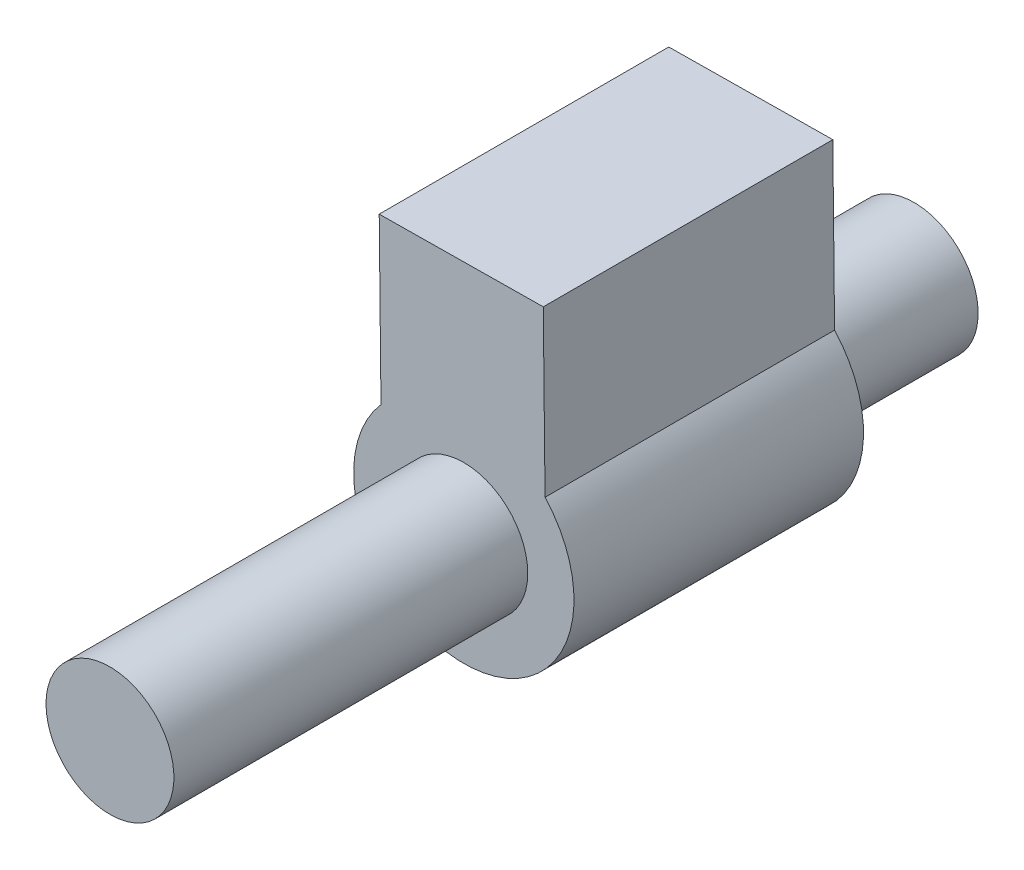
ISO-10303-21;
HEADER;
FILE_DESCRIPTION(('STEP AP214'),'2;1');
FILE_NAME('part.step','',(''),(''),'','','');
FILE_SCHEMA(('AUTOMOTIVE_DESIGN { 1 0 10303 214 1 1 1 1 }'));
ENDSEC;
DATA;
#1=APPLICATION_CONTEXT('core data for automotive mechanical design processes');
#2=APPLICATION_PROTOCOL_DEFINITION('international standard','automotive_design',2000,#1);
#3=PRODUCT_CONTEXT('',#1,'mechanical');
#4=PRODUCT('Part','Part','',(#3));
#5=PRODUCT_RELATED_PRODUCT_CATEGORY('part','',(#4));
#6=PRODUCT_DEFINITION_FORMATION('','',#4);
#7=PRODUCT_DEFINITION_CONTEXT('part definition',#1,'design');
#8=PRODUCT_DEFINITION('design','',#6,#7);
#9=PRODUCT_DEFINITION_SHAPE('','',#8);
#10=(LENGTH_UNIT() NAMED_UNIT(*) SI_UNIT(.MILLI.,.METRE.));
#11=(NAMED_UNIT(*) PLANE_ANGLE_UNIT() SI_UNIT($,.RADIAN.));
#12=(NAMED_UNIT(*) SI_UNIT($,.STERADIAN.) SOLID_ANGLE_UNIT());
#13=UNCERTAINTY_MEASURE_WITH_UNIT(LENGTH_MEASURE(1.E-05),#10,'distance_accuracy_value','');
#14=(GEOMETRIC_REPRESENTATION_CONTEXT(3) GLOBAL_UNCERTAINTY_ASSIGNED_CONTEXT((#13)) GLOBAL_UNIT_ASSIGNED_CONTEXT((#10,
#11,#12)) REPRESENTATION_CONTEXT('',''));
#15=CARTESIAN_POINT('',(0.,0.,0.));
#16=DIRECTION('',(0.,0.,1.));
#17=DIRECTION('',(1.,0.,0.));
#18=AXIS2_PLACEMENT_3D('',#15,#16,#17);
#19=CARTESIAN_POINT('',(0.877948062338801,0.00945442115652128,18.));
#20=DIRECTION('',(-0.999942021834013,-0.0107681461034695,0.));
#21=DIRECTION('',(0.0107681461034695,-0.999942021834013,0.));
#22=AXIS2_PLACEMENT_3D('',#19,#20,#21);
#23=PLANE('',#22);
#24=DIRECTION('',(-0.0107681461034695,0.999942021834013,0.));
#25=VECTOR('',#24,1.);
#26=CARTESIAN_POINT('',(0.877948062338801,0.00945442115652128,0.));
#27=LINE('',#26,#25);
#28=CARTESIAN_POINT('',(0.810681556908006,6.25589691885864,0.));
#29=VERTEX_POINT('',#28);
#30=CARTESIAN_POINT('',(0.700840098246295,16.4558969188586,0.));
#31=VERTEX_POINT('',#30);
#32=EDGE_CURVE('E104',#29,#31,#27,.T.);
#33=ORIENTED_EDGE('',*,*,#32,.F.);
#34=DIRECTION('',(0.,0.,-1.));
#35=VECTOR('',#34,1.);
#36=CARTESIAN_POINT('',(0.810681556908006,6.25589691885864,18.));
#37=LINE('',#36,#35);
#38=CARTESIAN_POINT('',(0.810681556908006,6.25589691885864,18.));
#39=VERTEX_POINT('',#38);
#40=EDGE_CURVE('E45',#39,#29,#37,.T.);
#41=ORIENTED_EDGE('',*,*,#40,.F.);
#42=DIRECTION('',(-0.0107681461034695,0.999942021834013,0.));
#43=VECTOR('',#42,1.);
#44=CARTESIAN_POINT('',(0.877948062338801,0.00945442115652128,18.));
#45=LINE('',#44,#43);
#46=CARTESIAN_POINT('',(0.700840098246295,16.4558969188586,18.));
#47=VERTEX_POINT('',#46);
#48=EDGE_CURVE('E87',#39,#47,#45,.T.);
#49=ORIENTED_EDGE('',*,*,#48,.T.);
#50=DIRECTION('',(0.,0.,-1.));
#51=VECTOR('',#50,1.);
#52=CARTESIAN_POINT('',(0.700840098246295,16.4558969188586,18.));
#53=LINE('',#52,#51);
#54=EDGE_CURVE('E54',#47,#31,#53,.T.);
#55=ORIENTED_EDGE('',*,*,#54,.T.);
#56=EDGE_LOOP('',(#33,#41,#49,#55));
#57=FACE_BOUND('',#56,.T.);
#58=ADVANCED_FACE('F36',(#57),#23,.T.);
#59=CARTESIAN_POINT('',(5.9599209389951,1.73839387116035,18.));
#60=DIRECTION('',(0.,0.,-1.));
#61=DIRECTION('',(-1.,0.,0.));
#62=AXIS2_PLACEMENT_3D('',#59,#60,#61);
#63=CYLINDRICAL_SURFACE('',#62,6.85);
#64=CARTESIAN_POINT('',(5.9599209389951,1.73839387116035,0.));
#65=DIRECTION('',(0.,0.,1.));
#66=DIRECTION('',(1.,0.,0.));
#67=AXIS2_PLACEMENT_3D('',#64,#65,#66);
#68=CIRCLE('',#67,6.85);
#69=CARTESIAN_POINT('',(11.010681556908,6.36573837752035,0.));
#70=VERTEX_POINT('',#69);
#71=EDGE_CURVE('E94',#29,#70,#68,.T.);
#72=ORIENTED_EDGE('',*,*,#71,.T.);
#73=DIRECTION('',(0.,0.,-1.));
#74=VECTOR('',#73,1.);
#75=CARTESIAN_POINT('',(11.010681556908,6.36573837752035,18.));
#76=LINE('',#75,#74);
#77=CARTESIAN_POINT('',(11.010681556908,6.36573837752035,18.));
#78=VERTEX_POINT('',#77);
#79=EDGE_CURVE('E91',#78,#70,#76,.T.);
#80=ORIENTED_EDGE('',*,*,#79,.F.);
#81=CARTESIAN_POINT('',(5.9599209389951,1.73839387116035,18.));
#82=DIRECTION('',(0.,0.,1.));
#83=DIRECTION('',(1.,0.,0.));
#84=AXIS2_PLACEMENT_3D('',#81,#82,#83);
#85=CIRCLE('',#84,6.85);
#86=EDGE_CURVE('E81',#39,#78,#85,.T.);
#87=ORIENTED_EDGE('',*,*,#86,.F.);
#88=ORIENTED_EDGE('',*,*,#40,.T.);
#89=EDGE_LOOP('',(#72,#80,#87,#88));
#90=FACE_BOUND('',#89,.T.);
#91=ADVANCED_FACE('F92',(#90),#63,.T.);
#92=CARTESIAN_POINT('',(11.0779480623388,0.119295879818234,18.));
#93=DIRECTION('',(-0.999942021834013,-0.0107681461034696,0.));
#94=DIRECTION('',(0.0107681461034696,-0.999942021834013,0.));
#95=AXIS2_PLACEMENT_3D('',#92,#93,#94);
#96=PLANE('',#95);
#97=DIRECTION('',(-0.0107681461034696,0.999942021834013,0.));
#98=VECTOR('',#97,1.);
#99=CARTESIAN_POINT('',(11.0779480623388,0.119295879818234,0.));
#100=LINE('',#99,#98);
#101=CARTESIAN_POINT('',(10.9008400982463,16.5657383775204,0.));
#102=VERTEX_POINT('',#101);
#103=EDGE_CURVE('E107',#70,#102,#100,.T.);
#104=ORIENTED_EDGE('',*,*,#103,.T.);
#105=DIRECTION('',(0.,0.,-1.));
#106=VECTOR('',#105,1.);
#107=CARTESIAN_POINT('',(10.9008400982463,16.5657383775204,18.));
#108=LINE('',#107,#106);
#109=CARTESIAN_POINT('',(10.9008400982463,16.5657383775204,18.));
#110=VERTEX_POINT('',#109);
#111=EDGE_CURVE('E69',#110,#102,#108,.T.);
#112=ORIENTED_EDGE('',*,*,#111,.F.);
#113=DIRECTION('',(-0.0107681461034696,0.999942021834013,0.));
#114=VECTOR('',#113,1.);
#115=CARTESIAN_POINT('',(11.0779480623388,0.119295879818234,18.));
#116=LINE('',#115,#114);
#117=EDGE_CURVE('E86',#78,#110,#116,.T.);
#118=ORIENTED_EDGE('',*,*,#117,.F.);
#119=ORIENTED_EDGE('',*,*,#79,.T.);
#120=EDGE_LOOP('',(#104,#112,#118,#119));
#121=FACE_BOUND('',#120,.T.);
#122=ADVANCED_FACE('F98',(#121),#96,.F.);
#123=CARTESIAN_POINT('',(-0.177107964092502,16.4464424977021,18.));
#124=DIRECTION('',(-0.0107681461034692,0.999942021834013,0.));
#125=DIRECTION('',(-0.999942021834013,-0.0107681461034692,0.));
#126=AXIS2_PLACEMENT_3D('',#123,#124,#125);
#127=PLANE('',#126);
#128=DIRECTION('',(0.999942021834013,0.0107681461034692,0.));
#129=VECTOR('',#128,1.);
#130=CARTESIAN_POINT('',(-0.177107964092502,16.4464424977021,0.));
#131=LINE('',#130,#129);
#132=EDGE_CURVE('E109',#31,#102,#131,.T.);
#133=ORIENTED_EDGE('',*,*,#132,.F.);
#134=ORIENTED_EDGE('',*,*,#54,.F.);
#135=DIRECTION('',(0.999942021834013,0.0107681461034692,0.));
#136=VECTOR('',#135,1.);
#137=CARTESIAN_POINT('',(-0.177107964092502,16.4464424977021,18.));
#138=LINE('',#137,#136);
#139=EDGE_CURVE('E99',#47,#110,#138,.T.);
#140=ORIENTED_EDGE('',*,*,#139,.T.);
#141=ORIENTED_EDGE('',*,*,#111,.T.);
#142=EDGE_LOOP('',(#133,#134,#140,#141));
#143=FACE_BOUND('',#142,.T.);
#144=ADVANCED_FACE('F122',(#143),#127,.T.);
#145=CARTESIAN_POINT('',(0.,0.,18.));
#146=DIRECTION('',(0.,0.,1.));
#147=DIRECTION('',(1.,0.,0.));
#148=AXIS2_PLACEMENT_3D('',#145,#146,#147);
#149=PLANE('',#148);
#150=CARTESIAN_POINT('',(5.9599209389951,1.73839387116035,18.));
#151=DIRECTION('',(0.,0.,1.));
#152=DIRECTION('',(1.,0.,0.));
#153=AXIS2_PLACEMENT_3D('',#150,#151,#152);
#154=CIRCLE('',#153,3.975);
#155=CARTESIAN_POINT('',(9.9349209389951,1.73839387116035,18.));
#156=VERTEX_POINT('',#155);
#157=EDGE_CURVE('E11',#156,#156,#154,.T.);
#158=ORIENTED_EDGE('',*,*,#157,.F.);
#159=EDGE_LOOP('',(#158));
#160=FACE_BOUND('',#159,.T.);
#161=ORIENTED_EDGE('',*,*,#48,.F.);
#162=ORIENTED_EDGE('',*,*,#86,.T.);
#163=ORIENTED_EDGE('',*,*,#117,.T.);
#164=ORIENTED_EDGE('',*,*,#139,.F.);
#165=EDGE_LOOP('',(#161,#162,#163,#164));
#166=FACE_BOUND('',#165,.T.);
#167=ADVANCED_FACE('F83',(#160,#166),#149,.T.);
#168=CARTESIAN_POINT('',(0.,0.,0.));
#169=DIRECTION('',(0.,0.,1.));
#170=DIRECTION('',(1.,0.,0.));
#171=AXIS2_PLACEMENT_3D('',#168,#169,#170);
#172=PLANE('',#171);
#173=CARTESIAN_POINT('',(5.9599209389951,1.73839387116035,0.));
#174=DIRECTION('',(0.,0.,1.));
#175=DIRECTION('',(1.,0.,0.));
#176=AXIS2_PLACEMENT_3D('',#173,#174,#175);
#177=CIRCLE('',#176,3.975);
#178=CARTESIAN_POINT('',(9.9349209389951,1.73839387116035,0.));
#179=VERTEX_POINT('',#178);
#180=EDGE_CURVE('E39',#179,#179,#177,.T.);
#181=ORIENTED_EDGE('',*,*,#180,.T.);
#182=EDGE_LOOP('',(#181));
#183=FACE_BOUND('',#182,.T.);
#184=ORIENTED_EDGE('',*,*,#32,.T.);
#185=ORIENTED_EDGE('',*,*,#132,.T.);
#186=ORIENTED_EDGE('',*,*,#103,.F.);
#187=ORIENTED_EDGE('',*,*,#71,.F.);
#188=EDGE_LOOP('',(#184,#185,#186,#187));
#189=FACE_BOUND('',#188,.T.);
#190=ADVANCED_FACE('F114',(#183,#189),#172,.F.);
#191=CARTESIAN_POINT('',(5.9599209389951,1.73839387116035,-10.));
#192=DIRECTION('',(0.,0.,-1.));
#193=DIRECTION('',(-1.,0.,0.));
#194=AXIS2_PLACEMENT_3D('',#191,#192,#193);
#195=PLANE('',#194);
#196=CARTESIAN_POINT('',(5.9599209389951,1.73839387116035,-10.));
#197=DIRECTION('',(0.,0.,-1.));
#198=DIRECTION('',(-1.,0.,0.));
#199=AXIS2_PLACEMENT_3D('',#196,#197,#198);
#200=CIRCLE('',#199,3.975);
#201=CARTESIAN_POINT('',(1.9849209389951,1.73839387116035,-10.));
#202=VERTEX_POINT('',#201);
#203=EDGE_CURVE('E151',#202,#202,#200,.T.);
#204=ORIENTED_EDGE('',*,*,#203,.T.);
#205=EDGE_LOOP('',(#204));
#206=FACE_BOUND('',#205,.T.);
#207=ADVANCED_FACE('F129',(#206),#195,.T.);
#208=CARTESIAN_POINT('',(5.9599209389951,1.73839387116035,40.));
#209=DIRECTION('',(0.,0.,-1.));
#210=DIRECTION('',(-1.,0.,0.));
#211=AXIS2_PLACEMENT_3D('',#208,#209,#210);
#212=CYLINDRICAL_SURFACE('',#211,3.975);
#213=ORIENTED_EDGE('',*,*,#203,.F.);
#214=EDGE_LOOP('',(#213));
#215=FACE_BOUND('',#214,.T.);
#216=ORIENTED_EDGE('',*,*,#180,.F.);
#217=EDGE_LOOP('',(#216));
#218=FACE_BOUND('',#217,.T.);
#219=ADVANCED_FACE('F138',(#215,#218),#212,.T.);
#220=ORIENTED_EDGE('',*,*,#157,.T.);
#221=EDGE_LOOP('',(#220));
#222=FACE_BOUND('',#221,.T.);
#223=CARTESIAN_POINT('',(5.9599209389951,1.73839387116035,40.));
#224=DIRECTION('',(0.,0.,-1.));
#225=DIRECTION('',(-1.,0.,0.));
#226=AXIS2_PLACEMENT_3D('',#223,#224,#225);
#227=CIRCLE('',#226,3.975);
#228=CARTESIAN_POINT('',(1.9849209389951,1.73839387116035,40.));
#229=VERTEX_POINT('',#228);
#230=EDGE_CURVE('E152',#229,#229,#227,.T.);
#231=ORIENTED_EDGE('',*,*,#230,.T.);
#232=EDGE_LOOP('',(#231));
#233=FACE_BOUND('',#232,.T.);
#234=ADVANCED_FACE('F134',(#222,#233),#212,.T.);
#235=CARTESIAN_POINT('',(5.9599209389951,1.73839387116035,40.));
#236=DIRECTION('',(0.,0.,-1.));
#237=DIRECTION('',(-1.,0.,0.));
#238=AXIS2_PLACEMENT_3D('',#235,#236,#237);
#239=PLANE('',#238);
#240=ORIENTED_EDGE('',*,*,#230,.F.);
#241=EDGE_LOOP('',(#240));
#242=FACE_BOUND('',#241,.T.);
#243=ADVANCED_FACE('F137',(#242),#239,.F.);
#244=CLOSED_SHELL('',(#58,#91,#122,#144,#167,#190,#207,#219,#234,#243));
#245=MANIFOLD_SOLID_BREP('B2',#244);
#246=ADVANCED_BREP_SHAPE_REPRESENTATION('',(#18,#245),#14);
#247=SHAPE_DEFINITION_REPRESENTATION(#9,#246);
ENDSEC;
END-ISO-10303-21;
